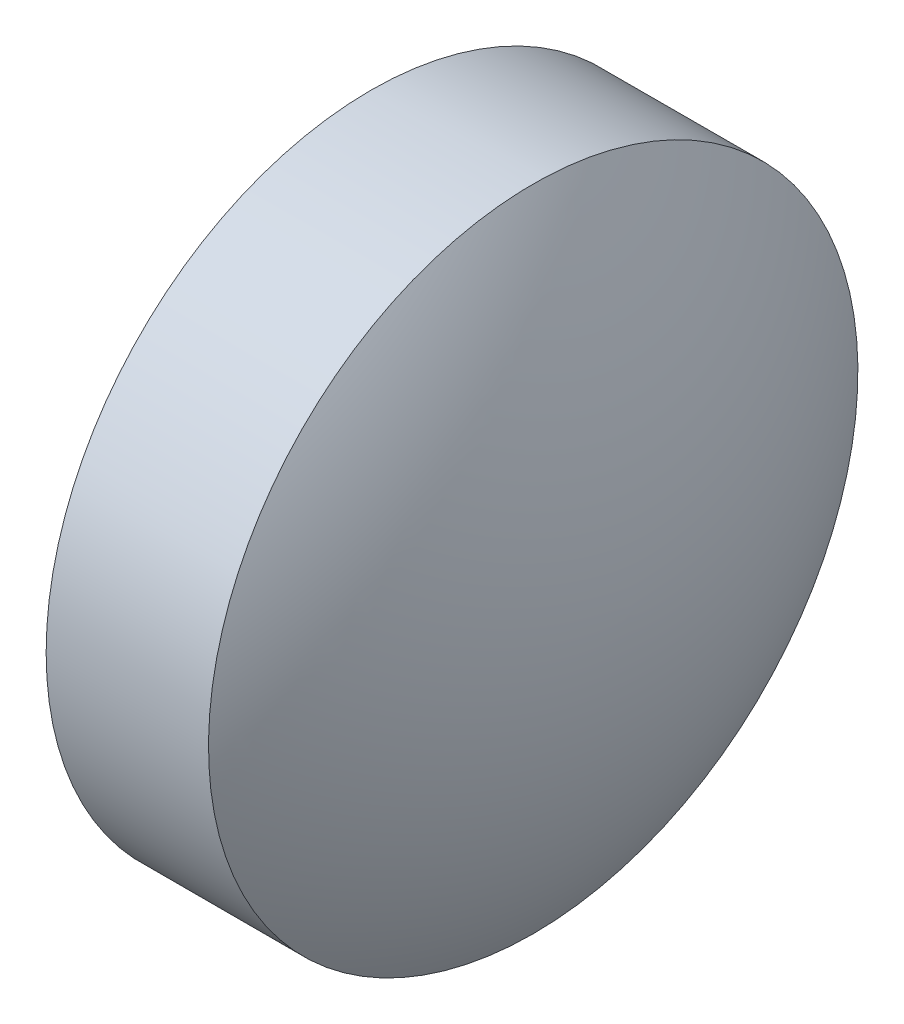
ISO-10303-21;
HEADER;
FILE_DESCRIPTION(('STEP AP214'),'2;1');
FILE_NAME('part.step','',(''),(''),'','','');
FILE_SCHEMA(('AUTOMOTIVE_DESIGN { 1 0 10303 214 1 1 1 1 }'));
ENDSEC;
DATA;
#1=APPLICATION_CONTEXT('core data for automotive mechanical design processes');
#2=APPLICATION_PROTOCOL_DEFINITION('international standard','automotive_design',2000,#1);
#3=PRODUCT_CONTEXT('',#1,'mechanical');
#4=PRODUCT('Part','Part','',(#3));
#5=PRODUCT_RELATED_PRODUCT_CATEGORY('part','',(#4));
#6=PRODUCT_DEFINITION_FORMATION('','',#4);
#7=PRODUCT_DEFINITION_CONTEXT('part definition',#1,'design');
#8=PRODUCT_DEFINITION('design','',#6,#7);
#9=PRODUCT_DEFINITION_SHAPE('','',#8);
#10=(LENGTH_UNIT() NAMED_UNIT(*) SI_UNIT(.MILLI.,.METRE.));
#11=(NAMED_UNIT(*) PLANE_ANGLE_UNIT() SI_UNIT($,.RADIAN.));
#12=(NAMED_UNIT(*) SI_UNIT($,.STERADIAN.) SOLID_ANGLE_UNIT());
#13=UNCERTAINTY_MEASURE_WITH_UNIT(LENGTH_MEASURE(1.E-05),#10,'distance_accuracy_value','');
#14=(GEOMETRIC_REPRESENTATION_CONTEXT(3) GLOBAL_UNCERTAINTY_ASSIGNED_CONTEXT((#13)) GLOBAL_UNIT_ASSIGNED_CONTEXT((#10,
#11,#12)) REPRESENTATION_CONTEXT('',''));
#15=CARTESIAN_POINT('',(0.,0.,0.));
#16=DIRECTION('',(0.,0.,1.));
#17=DIRECTION('',(1.,0.,0.));
#18=AXIS2_PLACEMENT_3D('',#15,#16,#17);
#19=CARTESIAN_POINT('',(12.9239482856117,5.24210197672942,0.));
#20=DIRECTION('',(-1.,0.,0.));
#21=DIRECTION('',(0.,1.,0.));
#22=AXIS2_PLACEMENT_3D('',#19,#20,#21);
#23=SPHERICAL_SURFACE('',#22,3.78402186262442);
#24=CARTESIAN_POINT('',(9.71165604224091,5.24210197672938,0.));
#25=DIRECTION('',(-1.,0.,0.));
#26=DIRECTION('',(0.,-1.,0.));
#27=AXIS2_PLACEMENT_3D('',#24,#25,#26);
#28=CIRCLE('',#27,2.00000000000003);
#29=CARTESIAN_POINT('',(9.71165604224079,3.24210197672935,0.));
#30=VERTEX_POINT('',#29);
#31=EDGE_CURVE('E43',#30,#30,#28,.T.);
#32=ORIENTED_EDGE('',*,*,#31,.T.);
#33=EDGE_LOOP('',(#32));
#34=FACE_BOUND('',#33,.T.);
#35=ADVANCED_FACE('F37',(#34),#23,.T.);
#36=CARTESIAN_POINT('',(7.51599715172247,5.26857322307591,0.));
#37=DIRECTION('',(0.,0.,-1.));
#38=DIRECTION('',(0.,-1.,0.));
#39=AXIS2_PLACEMENT_3D('',#36,#37,#38);
#40=CIRCLE('',#39,3.78402186262425);
#41=TRIMMED_CURVE('',#40,(PARAMETER_VALUE(-1.5638007376524)),(PARAMETER_VALUE(1.5638007376524)),
.T.,.PARAMETER.);
#42=CARTESIAN_POINT('',(7.51599715172247,5.24210197672951,0.));
#43=DIRECTION('',(-1.,0.,0.));
#44=AXIS1_PLACEMENT('',#42,#43);
#45=SURFACE_OF_REVOLUTION('',#41,#44);
#46=CARTESIAN_POINT('',(10.7116560422409,5.24210197672932,0.));
#47=DIRECTION('',(-1.,0.,0.));
#48=DIRECTION('',(0.,-1.,0.));
#49=AXIS2_PLACEMENT_3D('',#46,#47,#48);
#50=CIRCLE('',#49,2.00000000000009);
#51=CARTESIAN_POINT('',(10.7116560422408,3.24210197672923,0.));
#52=VERTEX_POINT('',#51);
#53=EDGE_CURVE('E11',#52,#52,#50,.T.);
#54=ORIENTED_EDGE('',*,*,#53,.F.);
#55=EDGE_LOOP('',(#54));
#56=FACE_BOUND('',#55,.T.);
#57=CARTESIAN_POINT('',(11.2999264229873,5.24210197672929,0.));
#58=VERTEX_POINT('',#57);
#59=VERTEX_LOOP('',#58);
#60=FACE_BOUND('',#59,.T.);
#61=ADVANCED_FACE('F46',(#56,#60),#45,.T.);
#62=CARTESIAN_POINT('',(9.13992642298731,5.24210197672942,0.));
#63=DIRECTION('',(-1.,0.,0.));
#64=DIRECTION('',(0.,-1.,0.));
#65=AXIS2_PLACEMENT_3D('',#62,#63,#64);
#66=CYLINDRICAL_SURFACE('',#65,2.00000000000006);
#67=ORIENTED_EDGE('',*,*,#53,.T.);
#68=EDGE_LOOP('',(#67));
#69=FACE_BOUND('',#68,.T.);
#70=ORIENTED_EDGE('',*,*,#31,.F.);
#71=EDGE_LOOP('',(#70));
#72=FACE_BOUND('',#71,.T.);
#73=ADVANCED_FACE('F48',(#69,#72),#66,.T.);
#74=CLOSED_SHELL('',(#35,#61,#73));
#75=MANIFOLD_SOLID_BREP('B2',#74);
#76=ADVANCED_BREP_SHAPE_REPRESENTATION('',(#18,#75),#14);
#77=SHAPE_DEFINITION_REPRESENTATION(#9,#76);
ENDSEC;
END-ISO-10303-21;
